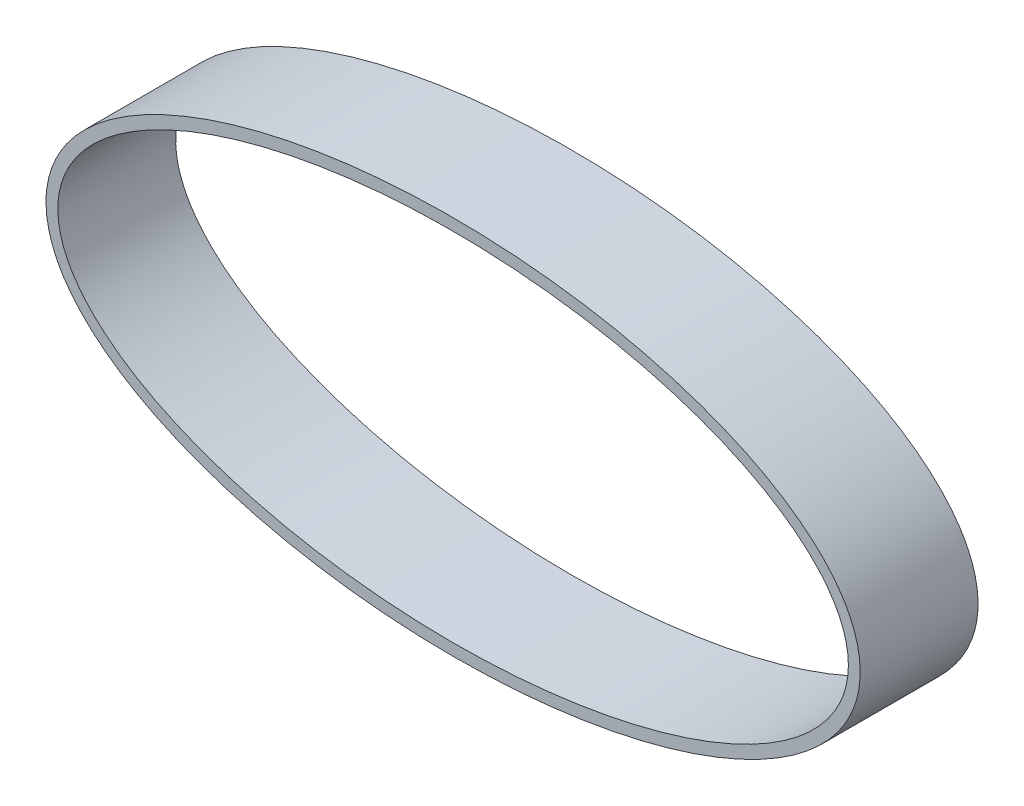
ISO-10303-21;
HEADER;
FILE_DESCRIPTION(('STEP AP214'),'2;1');
FILE_NAME('part.step','',(''),(''),'','','');
FILE_SCHEMA(('AUTOMOTIVE_DESIGN { 1 0 10303 214 1 1 1 1 }'));
ENDSEC;
DATA;
#1=APPLICATION_CONTEXT('core data for automotive mechanical design processes');
#2=APPLICATION_PROTOCOL_DEFINITION('international standard','automotive_design',2000,#1);
#3=PRODUCT_CONTEXT('',#1,'mechanical');
#4=PRODUCT('Part','Part','',(#3));
#5=PRODUCT_RELATED_PRODUCT_CATEGORY('part','',(#4));
#6=PRODUCT_DEFINITION_FORMATION('','',#4);
#7=PRODUCT_DEFINITION_CONTEXT('part definition',#1,'design');
#8=PRODUCT_DEFINITION('design','',#6,#7);
#9=PRODUCT_DEFINITION_SHAPE('','',#8);
#10=(LENGTH_UNIT() NAMED_UNIT(*) SI_UNIT(.MILLI.,.METRE.));
#11=(NAMED_UNIT(*) PLANE_ANGLE_UNIT() SI_UNIT($,.RADIAN.));
#12=(NAMED_UNIT(*) SI_UNIT($,.STERADIAN.) SOLID_ANGLE_UNIT());
#13=UNCERTAINTY_MEASURE_WITH_UNIT(LENGTH_MEASURE(1.E-05),#10,'distance_accuracy_value','');
#14=(GEOMETRIC_REPRESENTATION_CONTEXT(3) GLOBAL_UNCERTAINTY_ASSIGNED_CONTEXT((#13)) GLOBAL_UNIT_ASSIGNED_CONTEXT((#10,
#11,#12)) REPRESENTATION_CONTEXT('',''));
#15=CARTESIAN_POINT('',(0.,0.,0.));
#16=DIRECTION('',(0.,0.,1.));
#17=DIRECTION('',(1.,0.,0.));
#18=AXIS2_PLACEMENT_3D('',#15,#16,#17);
#19=CARTESIAN_POINT('',(34.5312368964968,-0.123358190978684,10.));
#20=DIRECTION('',(0.,0.,-1.));
#21=DIRECTION('',(-1.,0.,0.));
#22=AXIS2_PLACEMENT_3D('',#19,#20,#21);
#23=PLANE('',#22);
#24=CARTESIAN_POINT('',(-34.532210503035,0.,10.));
#25=CARTESIAN_POINT('',(-34.532210503035,-0.873944519003705,10.));
#26=CARTESIAN_POINT('',(-34.3871095818323,-1.72061058859918,10.));
#27=CARTESIAN_POINT('',(-34.0469461101206,-2.74909173257674,10.));
#28=CARTESIAN_POINT('',(-33.9705311178031,-2.95407740787535,10.));
#29=CARTESIAN_POINT('',(-33.8044826283516,-3.3553390889382,10.));
#30=CARTESIAN_POINT('',(-33.7147934594579,-3.55201421815434,10.));
#31=CARTESIAN_POINT('',(-33.427382794695,-4.13115272454852,10.));
#32=CARTESIAN_POINT('',(-33.2113849778042,-4.50276888905826,10.));
#33=CARTESIAN_POINT('',(-32.7373334640333,-5.22104055593717,10.));
#34=CARTESIAN_POINT('',(-32.4790651834824,-5.56790581724274,10.));
#35=CARTESIAN_POINT('',(-31.9260467709701,-6.23861260181861,10.));
#36=CARTESIAN_POINT('',(-31.6353697535883,-6.55764264483964,10.));
#37=CARTESIAN_POINT('',(-30.7281877934471,-7.47423388927086,10.));
#38=CARTESIAN_POINT('',(-30.0769106226028,-8.03173249958757,10.));
#39=CARTESIAN_POINT('',(-28.7052516458894,-9.06711127503819,10.));
#40=CARTESIAN_POINT('',(-27.9809231768284,-9.54665045882953,10.));
#41=CARTESIAN_POINT('',(-26.5023071222031,-10.4267193414078,10.));
#42=CARTESIAN_POINT('',(-25.7463799814153,-10.8289030797833,10.));
#43=CARTESIAN_POINT('',(-23.4393098723335,-11.9459727223177,10.));
#44=CARTESIAN_POINT('',(-21.8494310815011,-12.5726362244087,10.));
#45=CARTESIAN_POINT('',(-19.4083450055088,-13.3844790835292,10.));
#46=CARTESIAN_POINT('',(-18.5830247322888,-13.6338203861641,10.));
#47=CARTESIAN_POINT('',(-16.9275601920344,-14.0900540578259,10.));
#48=CARTESIAN_POINT('',(-16.0973099709851,-14.2971213239714,10.));
#49=CARTESIAN_POINT('',(-13.5998611217623,-14.8623276169743,10.));
#50=CARTESIAN_POINT('',(-11.9260174697792,-15.1649155643745,10.));
#51=CARTESIAN_POINT('',(-8.5632431043896,-15.6439666217202,10.));
#52=CARTESIAN_POINT('',(-6.87428666977261,-15.8202147074532,10.));
#53=CARTESIAN_POINT('',(-3.48240646862923,-16.0559467578398,10.));
#54=CARTESIAN_POINT('',(-1.77947528179331,-16.1153686901793,10.));
#55=CARTESIAN_POINT('',(0.785300207704318,-16.1177376404529,10.));
#56=CARTESIAN_POINT('',(1.64323632622642,-16.1039579774622,10.));
#57=CARTESIAN_POINT('',(3.35655459809339,-16.0469853284632,10.));
#58=CARTESIAN_POINT('',(4.21027832604338,-16.0038963106411,10.));
#59=CARTESIAN_POINT('',(6.76260315287036,-15.8306215283163,10.));
#60=CARTESIAN_POINT('',(8.45241556182693,-15.656714909903,10.));
#61=CARTESIAN_POINT('',(11.807073267476,-15.1846984667109,10.));
#62=CARTESIAN_POINT('',(13.4719519494301,-14.8867547226744,10.));
#63=CARTESIAN_POINT('',(16.7730580941752,-14.1483368030207,10.));
#64=CARTESIAN_POINT('',(18.4093834376419,-13.7083495517079,10.));
#65=CARTESIAN_POINT('',(20.8366457329098,-12.9129296349559,10.));
#66=CARTESIAN_POINT('',(21.641158491304,-12.6250321610125,10.));
#67=CARTESIAN_POINT('',(23.239283301323,-11.995009767113,10.));
#68=CARTESIAN_POINT('',(24.0363235931072,-11.6512243159866,10.));
#69=CARTESIAN_POINT('',(25.5946655530939,-10.906968226272,10.));
#70=CARTESIAN_POINT('',(26.3566103651466,-10.5066365165293,10.));
#71=CARTESIAN_POINT('',(27.8384117124734,-9.63706376921402,10.));
#72=CARTESIAN_POINT('',(28.5583859173466,-9.16801538702211,10.));
#73=CARTESIAN_POINT('',(29.9436722531759,-8.14042275681316,10.));
#74=CARTESIAN_POINT('',(30.6133277409381,-7.5775623208103,10.));
#75=CARTESIAN_POINT('',(31.8427409456155,-6.35882812251175,10.));
#76=CARTESIAN_POINT('',(32.4055196641295,-5.70245886807889,10.));
#77=CARTESIAN_POINT('',(33.3851356917274,-4.25762252885484,10.));
#78=CARTESIAN_POINT('',(33.7856580547052,-3.49233641255779,10.));
#79=CARTESIAN_POINT('',(34.2134278353369,-2.26395999364066,10.));
#80=CARTESIAN_POINT('',(34.326912904907,-1.83831411351832,10.));
#81=CARTESIAN_POINT('',(34.4816800542292,-0.986100566054904,10.));
#82=CARTESIAN_POINT('',(34.5243992177123,-0.55652478230125,10.));
#83=CARTESIAN_POINT('',(34.5380745752813,0.309808400343473,10.));
#84=CARTESIAN_POINT('',(34.5080756835893,0.749794116099157,10.));
#85=CARTESIAN_POINT('',(34.3782938805671,1.60737812587379,10.));
#86=CARTESIAN_POINT('',(34.2790883319133,2.02793243161565,10.));
#87=CARTESIAN_POINT('',(34.01727524522,2.85382053065724,10.));
#88=CARTESIAN_POINT('',(33.8530725078767,3.26184214018356,10.));
#89=CARTESIAN_POINT('',(33.4756422600877,4.04299769115022,10.));
#90=CARTESIAN_POINT('',(33.2623204805535,4.41799470415901,10.));
#91=CARTESIAN_POINT('',(32.7938270592387,5.141489689722,10.));
#92=CARTESIAN_POINT('',(32.5386223028372,5.4899666943296,10.));
#93=CARTESIAN_POINT('',(31.9915538194405,6.16370849942624,10.));
#94=CARTESIAN_POINT('',(31.6995318213382,6.48876185459077,10.));
#95=CARTESIAN_POINT('',(30.7927609118112,7.4159335991851,10.));
#96=CARTESIAN_POINT('',(30.1421391265511,7.97790927797023,10.));
#97=CARTESIAN_POINT('',(28.7734762726992,9.0197739797189,10.));
#98=CARTESIAN_POINT('',(28.0529931304855,9.50059804577011,10.));
#99=CARTESIAN_POINT('',(26.5675431825133,10.3907692123838,10.));
#100=CARTESIAN_POINT('',(25.8088092532585,10.796678194801,10.));
#101=CARTESIAN_POINT('',(23.4951377131575,11.9227103682174,10.));
#102=CARTESIAN_POINT('',(21.9032731543994,12.5524671189251,10.));
#103=CARTESIAN_POINT('',(19.4625302488882,13.3675343303193,10.));
#104=CARTESIAN_POINT('',(18.6399305360938,13.6171530195711,10.));
#105=CARTESIAN_POINT('',(16.978598395897,14.0769109373072,10.));
#106=CARTESIAN_POINT('',(16.1417221428671,14.2864354657231,10.));
#107=CARTESIAN_POINT('',(13.6309777219131,14.8565106719708,10.));
#108=CARTESIAN_POINT('',(11.9501462317924,15.1609914386962,10.));
#109=CARTESIAN_POINT('',(8.57667727651167,15.6425342509654,10.));
#110=CARTESIAN_POINT('',(6.88401802733573,15.8193611874692,10.));
#111=CARTESIAN_POINT('',(3.48783396693269,16.055745964374,10.));
#112=CARTESIAN_POINT('',(1.78430256588971,16.1152326826595,10.));
#113=CARTESIAN_POINT('',(-0.779024520850426,16.1177972844464,10.));
#114=CARTESIAN_POINT('',(-1.63481087367187,16.104146822014,10.));
#115=CARTESIAN_POINT('',(-3.34911901563428,16.047323066841,10.));
#116=CARTESIAN_POINT('',(-4.20902428278281,16.0040461186817,10.));
#117=CARTESIAN_POINT('',(-6.78166028531582,15.8291977880084,10.));
#118=CARTESIAN_POINT('',(-8.4854403233601,15.6532731416705,10.));
#119=CARTESIAN_POINT('',(-11.8688660236933,15.1747647146376,10.));
#120=CARTESIAN_POINT('',(-13.5485461049307,14.8723615673371,10.));
#121=CARTESIAN_POINT('',(-16.8800765775895,14.1215028346178,10.));
#122=CARTESIAN_POINT('',(-18.5320288883731,13.6735821301641,10.));
#123=CARTESIAN_POINT('',(-20.9832996189775,12.8617991449826,10.));
#124=CARTESIAN_POINT('',(-21.796805384342,12.5671857432164,10.));
#125=CARTESIAN_POINT('',(-23.3977444205791,11.9282644901932,10.));
#126=CARTESIAN_POINT('',(-24.1869084521026,11.5835116191407,10.));
#127=CARTESIAN_POINT('',(-25.7381310292026,10.8333664190873,10.));
#128=CARTESIAN_POINT('',(-26.5027052170728,10.4265517118823,10.));
#129=CARTESIAN_POINT('',(-27.983711874333,9.5449211675419,10.));
#130=CARTESIAN_POINT('',(-28.6997150808953,9.07085958909996,10.));
#131=CARTESIAN_POINT('',(-30.0692396967987,8.0379495498862,10.));
#132=CARTESIAN_POINT('',(-30.7230553658525,7.47950039522818,10.));
#133=CARTESIAN_POINT('',(-31.9443213914709,6.24540562369329,10.));
#134=CARTESIAN_POINT('',(-32.4974271719859,5.58423081281907,10.));
#135=CARTESIAN_POINT('',(-33.2109763058451,4.50354254492351,10.));
#136=CARTESIAN_POINT('',(-33.4305370424292,4.12549501862472,10.));
#137=CARTESIAN_POINT('',(-33.8137602267832,3.35188434581081,10.));
#138=CARTESIAN_POINT('',(-33.9781608479697,2.95595824866651,10.));
#139=CARTESIAN_POINT('',(-34.2473900968652,2.14413830315949,10.));
#140=CARTESIAN_POINT('',(-34.3522527492137,1.72825585940983,10.));
#141=CARTESIAN_POINT('',(-34.495073375996,0.874065401000876,10.));
#142=CARTESIAN_POINT('',(-34.532210503035,0.436972259501861,10.));
#143=CARTESIAN_POINT('',(-34.532210503035,0.,10.));
#144=B_SPLINE_CURVE_WITH_KNOTS('',3,(#24,#25,#26,#27,#28,#29,#30,#31,#32,#33,#34,#35,#36,#37,
#38,#39,#40,#41,#42,#43,#44,#45,#46,#47,#48,#49,#50,#51,#52,#53,#54,#55,#56,#57,#58,#59,#60,#61,
#62,#63,#64,#65,#66,#67,#68,#69,#70,#71,#72,#73,#74,#75,#76,#77,#78,#79,#80,#81,#82,#83,#84,#85,
#86,#87,#88,#89,#90,#91,#92,#93,#94,#95,#96,#97,#98,#99,#100,#101,#102,#103,#104,#105,#106,#107,
#108,#109,#110,#111,#112,#113,#114,#115,#116,#117,#118,#119,#120,#121,#122,#123,#124,#125,#126,
#127,#128,#129,#130,#131,#132,#133,#134,#135,#136,#137,#138,#139,#140,#141,#142,#143),
.UNSPECIFIED.,.T.,.F.,(4,2,2,2,2,2,2,2,2,2,2,2,2,2,2,2,2,2,2,2,2,2,2,2,2,2,2,2,2,2,2,2,2,2,2,2,
2,2,2,2,2,2,2,2,2,2,2,2,2,2,2,2,2,2,2,2,2,2,2,4),(0.,0.0156249999999999,0.0195312499999999,
0.0234374999999998,0.0312499999999998,0.0390624999999998,0.0468749999999997,0.0624999999999998,
0.0781249999999998,0.0937499999999998,0.125,0.140625,0.15625,0.1875,0.21875,0.249999999999999,
0.265624999999999,0.281249999999999,0.312499999999999,0.343749999999999,0.374999999999999,
0.390624999999999,0.406249999999999,0.421874999999999,0.437499999999999,0.453124999999999,
0.468749999999999,0.484374999999999,0.492187499999999,0.499999999999999,0.507812499999999,
0.515624999999999,0.523437499999999,0.531249999999999,0.539062499999999,0.546874999999999,
0.562499999999999,0.578124999999999,0.593749999999999,0.624999999999999,0.640624999999999,
0.656249999999999,0.687499999999999,0.718749999999999,0.749999999999999,0.765624999999999,
0.781249999999999,0.812499999999999,0.843749999999999,0.874999999999999,0.890624999999999,
0.90625,0.921875,0.9375,0.953125,0.96875,0.9765625,0.984375,0.9921875,1.),.UNSPECIFIED.);
#145=CARTESIAN_POINT('',(-34.532210503035,0.,10.));
#146=VERTEX_POINT('',#145);
#147=EDGE_CURVE('E11',#146,#146,#144,.T.);
#148=ORIENTED_EDGE('',*,*,#147,.T.);
#149=EDGE_LOOP('',(#148));
#150=FACE_BOUND('',#149,.T.);
#151=CARTESIAN_POINT('',(0.,0.,10.));
#152=DIRECTION('',(0.,0.,1.));
#153=DIRECTION('',(1.,0.,0.));
#154=AXIS2_PLACEMENT_3D('',#151,#152,#153);
#155=ELLIPSE('',#154,33.532210503035,15.1169801448109);
#156=CARTESIAN_POINT('',(33.532210503035,0.,10.));
#157=VERTEX_POINT('',#156);
#158=EDGE_CURVE('E55',#157,#157,#155,.T.);
#159=ORIENTED_EDGE('',*,*,#158,.F.);
#160=EDGE_LOOP('',(#159));
#161=FACE_BOUND('',#160,.T.);
#162=ADVANCED_FACE('F42',(#150,#161),#23,.F.);
#163=CARTESIAN_POINT('',(34.5312368964968,-0.123358190978684,0.));
#164=DIRECTION('',(0.,0.,-1.));
#165=DIRECTION('',(-1.,0.,0.));
#166=AXIS2_PLACEMENT_3D('',#163,#164,#165);
#167=PLANE('',#166);
#168=CARTESIAN_POINT('',(-34.532210503035,0.,0.));
#169=CARTESIAN_POINT('',(-34.532210503035,-0.873944519003705,0.));
#170=CARTESIAN_POINT('',(-34.3871095818323,-1.72061058859918,0.));
#171=CARTESIAN_POINT('',(-34.0469461101206,-2.74909173257674,0.));
#172=CARTESIAN_POINT('',(-33.9705311178031,-2.95407740787535,0.));
#173=CARTESIAN_POINT('',(-33.8044826283516,-3.3553390889382,0.));
#174=CARTESIAN_POINT('',(-33.7147934594579,-3.55201421815434,0.));
#175=CARTESIAN_POINT('',(-33.427382794695,-4.13115272454852,0.));
#176=CARTESIAN_POINT('',(-33.2113849778042,-4.50276888905826,0.));
#177=CARTESIAN_POINT('',(-32.7373334640333,-5.22104055593717,0.));
#178=CARTESIAN_POINT('',(-32.4790651834824,-5.56790581724274,0.));
#179=CARTESIAN_POINT('',(-31.9260467709701,-6.23861260181861,0.));
#180=CARTESIAN_POINT('',(-31.6353697535883,-6.55764264483964,0.));
#181=CARTESIAN_POINT('',(-30.7281877934471,-7.47423388927086,0.));
#182=CARTESIAN_POINT('',(-30.0769106226028,-8.03173249958757,0.));
#183=CARTESIAN_POINT('',(-28.7052516458894,-9.06711127503819,0.));
#184=CARTESIAN_POINT('',(-27.9809231768284,-9.54665045882953,0.));
#185=CARTESIAN_POINT('',(-26.5023071222031,-10.4267193414078,0.));
#186=CARTESIAN_POINT('',(-25.7463799814153,-10.8289030797833,0.));
#187=CARTESIAN_POINT('',(-23.4393098723335,-11.9459727223177,0.));
#188=CARTESIAN_POINT('',(-21.8494310815011,-12.5726362244087,0.));
#189=CARTESIAN_POINT('',(-19.4083450055088,-13.3844790835292,0.));
#190=CARTESIAN_POINT('',(-18.5830247322888,-13.6338203861641,0.));
#191=CARTESIAN_POINT('',(-16.9275601920344,-14.0900540578259,0.));
#192=CARTESIAN_POINT('',(-16.0973099709851,-14.2971213239714,0.));
#193=CARTESIAN_POINT('',(-13.5998611217623,-14.8623276169743,0.));
#194=CARTESIAN_POINT('',(-11.9260174697792,-15.1649155643745,0.));
#195=CARTESIAN_POINT('',(-8.5632431043896,-15.6439666217202,0.));
#196=CARTESIAN_POINT('',(-6.87428666977261,-15.8202147074532,0.));
#197=CARTESIAN_POINT('',(-3.48240646862923,-16.0559467578398,0.));
#198=CARTESIAN_POINT('',(-1.77947528179331,-16.1153686901793,0.));
#199=CARTESIAN_POINT('',(0.785300207704318,-16.1177376404529,0.));
#200=CARTESIAN_POINT('',(1.64323632622642,-16.1039579774622,0.));
#201=CARTESIAN_POINT('',(3.35655459809339,-16.0469853284632,0.));
#202=CARTESIAN_POINT('',(4.21027832604338,-16.0038963106411,0.));
#203=CARTESIAN_POINT('',(6.76260315287036,-15.8306215283163,0.));
#204=CARTESIAN_POINT('',(8.45241556182693,-15.656714909903,0.));
#205=CARTESIAN_POINT('',(11.807073267476,-15.1846984667109,0.));
#206=CARTESIAN_POINT('',(13.4719519494301,-14.8867547226744,0.));
#207=CARTESIAN_POINT('',(16.7730580941752,-14.1483368030207,0.));
#208=CARTESIAN_POINT('',(18.4093834376419,-13.7083495517079,0.));
#209=CARTESIAN_POINT('',(20.8366457329098,-12.9129296349559,0.));
#210=CARTESIAN_POINT('',(21.641158491304,-12.6250321610125,0.));
#211=CARTESIAN_POINT('',(23.239283301323,-11.995009767113,0.));
#212=CARTESIAN_POINT('',(24.0363235931072,-11.6512243159866,0.));
#213=CARTESIAN_POINT('',(25.5946655530939,-10.906968226272,0.));
#214=CARTESIAN_POINT('',(26.3566103651466,-10.5066365165293,0.));
#215=CARTESIAN_POINT('',(27.8384117124734,-9.63706376921402,0.));
#216=CARTESIAN_POINT('',(28.5583859173466,-9.16801538702211,0.));
#217=CARTESIAN_POINT('',(29.9436722531759,-8.14042275681316,0.));
#218=CARTESIAN_POINT('',(30.6133277409381,-7.5775623208103,0.));
#219=CARTESIAN_POINT('',(31.8427409456155,-6.35882812251175,0.));
#220=CARTESIAN_POINT('',(32.4055196641295,-5.70245886807889,0.));
#221=CARTESIAN_POINT('',(33.3851356917274,-4.25762252885484,0.));
#222=CARTESIAN_POINT('',(33.7856580547052,-3.49233641255779,0.));
#223=CARTESIAN_POINT('',(34.2134278353369,-2.26395999364066,0.));
#224=CARTESIAN_POINT('',(34.326912904907,-1.83831411351832,0.));
#225=CARTESIAN_POINT('',(34.4816800542292,-0.986100566054904,0.));
#226=CARTESIAN_POINT('',(34.5243992177123,-0.55652478230125,0.));
#227=CARTESIAN_POINT('',(34.5380745752813,0.309808400343473,0.));
#228=CARTESIAN_POINT('',(34.5080756835893,0.749794116099157,0.));
#229=CARTESIAN_POINT('',(34.3782938805671,1.60737812587379,0.));
#230=CARTESIAN_POINT('',(34.2790883319133,2.02793243161565,0.));
#231=CARTESIAN_POINT('',(34.01727524522,2.85382053065724,0.));
#232=CARTESIAN_POINT('',(33.8530725078767,3.26184214018356,0.));
#233=CARTESIAN_POINT('',(33.4756422600877,4.04299769115022,0.));
#234=CARTESIAN_POINT('',(33.2623204805535,4.41799470415901,0.));
#235=CARTESIAN_POINT('',(32.7938270592387,5.141489689722,0.));
#236=CARTESIAN_POINT('',(32.5386223028372,5.4899666943296,0.));
#237=CARTESIAN_POINT('',(31.9915538194405,6.16370849942624,0.));
#238=CARTESIAN_POINT('',(31.6995318213382,6.48876185459077,0.));
#239=CARTESIAN_POINT('',(30.7927609118112,7.4159335991851,0.));
#240=CARTESIAN_POINT('',(30.1421391265511,7.97790927797023,0.));
#241=CARTESIAN_POINT('',(28.7734762726992,9.0197739797189,0.));
#242=CARTESIAN_POINT('',(28.0529931304855,9.50059804577011,0.));
#243=CARTESIAN_POINT('',(26.5675431825133,10.3907692123838,0.));
#244=CARTESIAN_POINT('',(25.8088092532585,10.796678194801,0.));
#245=CARTESIAN_POINT('',(23.4951377131575,11.9227103682174,0.));
#246=CARTESIAN_POINT('',(21.9032731543994,12.5524671189251,0.));
#247=CARTESIAN_POINT('',(19.4625302488882,13.3675343303193,0.));
#248=CARTESIAN_POINT('',(18.6399305360938,13.6171530195711,0.));
#249=CARTESIAN_POINT('',(16.978598395897,14.0769109373072,0.));
#250=CARTESIAN_POINT('',(16.1417221428671,14.2864354657231,0.));
#251=CARTESIAN_POINT('',(13.6309777219131,14.8565106719708,0.));
#252=CARTESIAN_POINT('',(11.9501462317924,15.1609914386962,0.));
#253=CARTESIAN_POINT('',(8.57667727651167,15.6425342509654,0.));
#254=CARTESIAN_POINT('',(6.88401802733573,15.8193611874692,0.));
#255=CARTESIAN_POINT('',(3.48783396693269,16.055745964374,0.));
#256=CARTESIAN_POINT('',(1.78430256588971,16.1152326826595,0.));
#257=CARTESIAN_POINT('',(-0.779024520850426,16.1177972844464,0.));
#258=CARTESIAN_POINT('',(-1.63481087367187,16.104146822014,0.));
#259=CARTESIAN_POINT('',(-3.34911901563428,16.047323066841,0.));
#260=CARTESIAN_POINT('',(-4.20902428278281,16.0040461186817,0.));
#261=CARTESIAN_POINT('',(-6.78166028531582,15.8291977880084,0.));
#262=CARTESIAN_POINT('',(-8.4854403233601,15.6532731416705,0.));
#263=CARTESIAN_POINT('',(-11.8688660236933,15.1747647146376,0.));
#264=CARTESIAN_POINT('',(-13.5485461049307,14.8723615673371,0.));
#265=CARTESIAN_POINT('',(-16.8800765775895,14.1215028346178,0.));
#266=CARTESIAN_POINT('',(-18.5320288883731,13.6735821301641,0.));
#267=CARTESIAN_POINT('',(-20.9832996189775,12.8617991449826,0.));
#268=CARTESIAN_POINT('',(-21.796805384342,12.5671857432164,0.));
#269=CARTESIAN_POINT('',(-23.3977444205791,11.9282644901932,0.));
#270=CARTESIAN_POINT('',(-24.1869084521026,11.5835116191407,0.));
#271=CARTESIAN_POINT('',(-25.7381310292026,10.8333664190873,0.));
#272=CARTESIAN_POINT('',(-26.5027052170728,10.4265517118823,0.));
#273=CARTESIAN_POINT('',(-27.983711874333,9.5449211675419,0.));
#274=CARTESIAN_POINT('',(-28.6997150808953,9.07085958909996,0.));
#275=CARTESIAN_POINT('',(-30.0692396967987,8.0379495498862,0.));
#276=CARTESIAN_POINT('',(-30.7230553658525,7.47950039522818,0.));
#277=CARTESIAN_POINT('',(-31.9443213914709,6.24540562369329,0.));
#278=CARTESIAN_POINT('',(-32.4974271719859,5.58423081281907,0.));
#279=CARTESIAN_POINT('',(-33.2109763058451,4.50354254492351,0.));
#280=CARTESIAN_POINT('',(-33.4305370424292,4.12549501862472,0.));
#281=CARTESIAN_POINT('',(-33.8137602267832,3.35188434581081,0.));
#282=CARTESIAN_POINT('',(-33.9781608479697,2.95595824866651,0.));
#283=CARTESIAN_POINT('',(-34.2473900968652,2.14413830315949,0.));
#284=CARTESIAN_POINT('',(-34.3522527492137,1.72825585940983,0.));
#285=CARTESIAN_POINT('',(-34.495073375996,0.874065401000876,0.));
#286=CARTESIAN_POINT('',(-34.532210503035,0.436972259501861,0.));
#287=CARTESIAN_POINT('',(-34.532210503035,0.,0.));
#288=B_SPLINE_CURVE_WITH_KNOTS('',3,(#168,#169,#170,#171,#172,#173,#174,#175,#176,#177,#178,
#179,#180,#181,#182,#183,#184,#185,#186,#187,#188,#189,#190,#191,#192,#193,#194,#195,#196,#197,
#198,#199,#200,#201,#202,#203,#204,#205,#206,#207,#208,#209,#210,#211,#212,#213,#214,#215,#216,
#217,#218,#219,#220,#221,#222,#223,#224,#225,#226,#227,#228,#229,#230,#231,#232,#233,#234,#235,
#236,#237,#238,#239,#240,#241,#242,#243,#244,#245,#246,#247,#248,#249,#250,#251,#252,#253,#254,
#255,#256,#257,#258,#259,#260,#261,#262,#263,#264,#265,#266,#267,#268,#269,#270,#271,#272,#273,
#274,#275,#276,#277,#278,#279,#280,#281,#282,#283,#284,#285,#286,#287),.UNSPECIFIED.,.T.,.F.,(4,
2,2,2,2,2,2,2,2,2,2,2,2,2,2,2,2,2,2,2,2,2,2,2,2,2,2,2,2,2,2,2,2,2,2,2,2,2,2,2,2,2,2,2,2,2,2,2,2,
2,2,2,2,2,2,2,2,2,2,4),(0.,0.0156249999999999,0.0195312499999999,0.0234374999999998,
0.0312499999999998,0.0390624999999998,0.0468749999999997,0.0624999999999998,0.0781249999999998,
0.0937499999999998,0.125,0.140625,0.15625,0.1875,0.21875,0.249999999999999,0.265624999999999,
0.281249999999999,0.312499999999999,0.343749999999999,0.374999999999999,0.390624999999999,
0.406249999999999,0.421874999999999,0.437499999999999,0.453124999999999,0.468749999999999,
0.484374999999999,0.492187499999999,0.499999999999999,0.507812499999999,0.515624999999999,
0.523437499999999,0.531249999999999,0.539062499999999,0.546874999999999,0.562499999999999,
0.578124999999999,0.593749999999999,0.624999999999999,0.640624999999999,0.656249999999999,
0.687499999999999,0.718749999999999,0.749999999999999,0.765624999999999,0.781249999999999,
0.812499999999999,0.843749999999999,0.874999999999999,0.890624999999999,0.90625,0.921875,0.9375,
0.953125,0.96875,0.9765625,0.984375,0.9921875,1.),.UNSPECIFIED.);
#289=CARTESIAN_POINT('',(-34.532210503035,0.,0.));
#290=VERTEX_POINT('',#289);
#291=EDGE_CURVE('E47',#290,#290,#288,.T.);
#292=ORIENTED_EDGE('',*,*,#291,.F.);
#293=EDGE_LOOP('',(#292));
#294=FACE_BOUND('',#293,.T.);
#295=CARTESIAN_POINT('',(0.,0.,0.));
#296=DIRECTION('',(0.,0.,1.));
#297=DIRECTION('',(1.,0.,0.));
#298=AXIS2_PLACEMENT_3D('',#295,#296,#297);
#299=ELLIPSE('',#298,33.532210503035,15.1169801448109);
#300=CARTESIAN_POINT('',(33.532210503035,0.,0.));
#301=VERTEX_POINT('',#300);
#302=EDGE_CURVE('E60',#301,#301,#299,.T.);
#303=ORIENTED_EDGE('',*,*,#302,.T.);
#304=EDGE_LOOP('',(#303));
#305=FACE_BOUND('',#304,.T.);
#306=ADVANCED_FACE('F74',(#294,#305),#167,.T.);
#307=DIRECTION('',(0.,0.,-1.));
#308=VECTOR('',#307,1.);
#309=SURFACE_OF_LINEAR_EXTRUSION('',#144,#308);
#310=ORIENTED_EDGE('',*,*,#147,.F.);
#311=EDGE_LOOP('',(#310));
#312=FACE_BOUND('',#311,.T.);
#313=ORIENTED_EDGE('',*,*,#291,.T.);
#314=EDGE_LOOP('',(#313));
#315=FACE_BOUND('',#314,.T.);
#316=ADVANCED_FACE('F44',(#312,#315),#309,.F.);
#317=DIRECTION('',(0.,0.,-1.));
#318=VECTOR('',#317,1.);
#319=SURFACE_OF_LINEAR_EXTRUSION('',#155,#318);
#320=ORIENTED_EDGE('',*,*,#158,.T.);
#321=EDGE_LOOP('',(#320));
#322=FACE_BOUND('',#321,.T.);
#323=ORIENTED_EDGE('',*,*,#302,.F.);
#324=EDGE_LOOP('',(#323));
#325=FACE_BOUND('',#324,.T.);
#326=ADVANCED_FACE('F69',(#322,#325),#319,.T.);
#327=CLOSED_SHELL('',(#162,#306,#316,#326));
#328=MANIFOLD_SOLID_BREP('B2',#327);
#329=ADVANCED_BREP_SHAPE_REPRESENTATION('',(#18,#328),#14);
#330=SHAPE_DEFINITION_REPRESENTATION(#9,#329);
ENDSEC;
END-ISO-10303-21;
